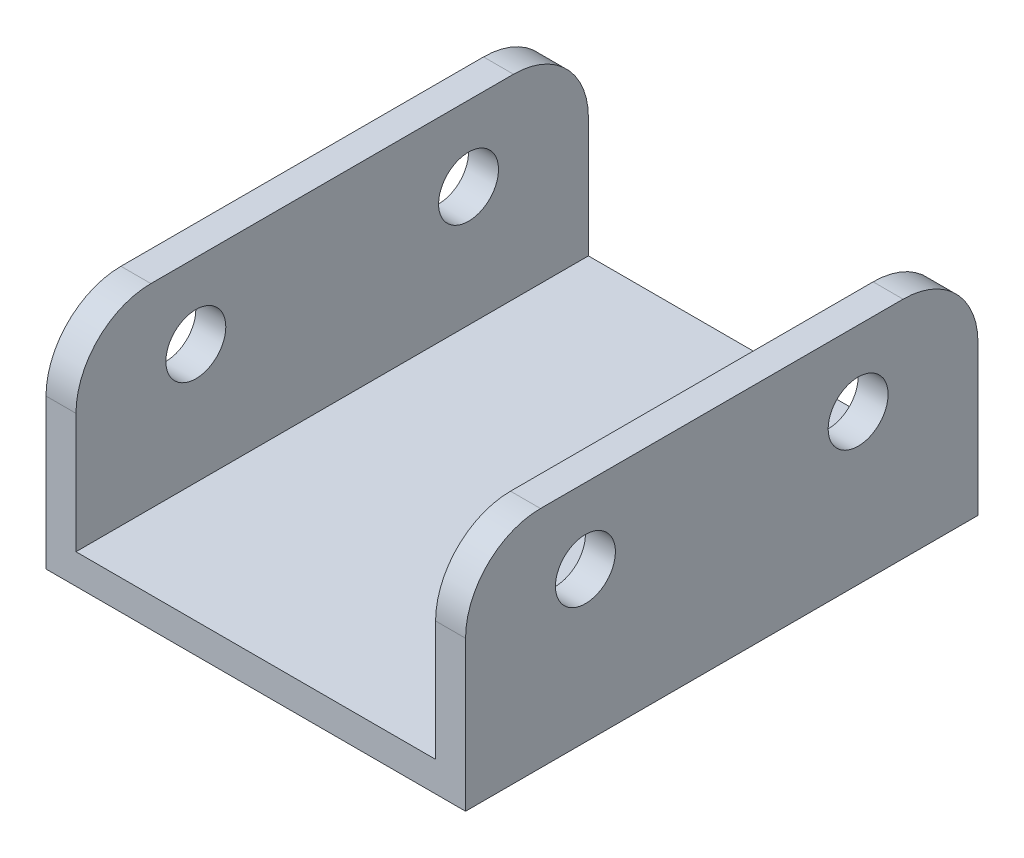
ISO-10303-21;
HEADER;
FILE_DESCRIPTION(('STEP AP214'),'2;1');
FILE_NAME('part.step','',(''),(''),'','','');
FILE_SCHEMA(('AUTOMOTIVE_DESIGN { 1 0 10303 214 1 1 1 1 }'));
ENDSEC;
DATA;
#1=APPLICATION_CONTEXT('core data for automotive mechanical design processes');
#2=APPLICATION_PROTOCOL_DEFINITION('international standard','automotive_design',2000,#1);
#3=PRODUCT_CONTEXT('',#1,'mechanical');
#4=PRODUCT('Part','Part','',(#3));
#5=PRODUCT_RELATED_PRODUCT_CATEGORY('part','',(#4));
#6=PRODUCT_DEFINITION_FORMATION('','',#4);
#7=PRODUCT_DEFINITION_CONTEXT('part definition',#1,'design');
#8=PRODUCT_DEFINITION('design','',#6,#7);
#9=PRODUCT_DEFINITION_SHAPE('','',#8);
#10=(LENGTH_UNIT() NAMED_UNIT(*) SI_UNIT(.MILLI.,.METRE.));
#11=(NAMED_UNIT(*) PLANE_ANGLE_UNIT() SI_UNIT($,.RADIAN.));
#12=(NAMED_UNIT(*) SI_UNIT($,.STERADIAN.) SOLID_ANGLE_UNIT());
#13=UNCERTAINTY_MEASURE_WITH_UNIT(LENGTH_MEASURE(1.E-05),#10,'distance_accuracy_value','');
#14=(GEOMETRIC_REPRESENTATION_CONTEXT(3) GLOBAL_UNCERTAINTY_ASSIGNED_CONTEXT((#13)) GLOBAL_UNIT_ASSIGNED_CONTEXT((#10,
#11,#12)) REPRESENTATION_CONTEXT('',''));
#15=CARTESIAN_POINT('',(0.,0.,0.));
#16=DIRECTION('',(0.,0.,1.));
#17=DIRECTION('',(1.,0.,0.));
#18=AXIS2_PLACEMENT_3D('',#15,#16,#17);
#19=CARTESIAN_POINT('',(-14.,-1.00000000000001,17.1));
#20=DIRECTION('',(1.,0.,0.));
#21=DIRECTION('',(0.,1.,0.));
#22=AXIS2_PLACEMENT_3D('',#19,#20,#21);
#23=PLANE('',#22);
#24=CARTESIAN_POINT('',(-14.,8.99999999999999,9.1));
#25=DIRECTION('',(1.,0.,0.));
#26=DIRECTION('',(0.,0.,-1.));
#27=AXIS2_PLACEMENT_3D('',#24,#25,#26);
#28=CIRCLE('',#27,2.);
#29=CARTESIAN_POINT('',(-14.,8.99999999999999,7.1));
#30=VERTEX_POINT('',#29);
#31=EDGE_CURVE('E158',#30,#30,#28,.T.);
#32=ORIENTED_EDGE('',*,*,#31,.T.);
#33=EDGE_LOOP('',(#32));
#34=FACE_BOUND('',#33,.T.);
#35=CARTESIAN_POINT('',(-14.,8.99999999999999,-9.1));
#36=DIRECTION('',(1.,0.,0.));
#37=DIRECTION('',(0.,0.,1.));
#38=AXIS2_PLACEMENT_3D('',#35,#36,#37);
#39=CIRCLE('',#38,2.);
#40=CARTESIAN_POINT('',(-14.,8.99999999999999,-7.1));
#41=VERTEX_POINT('',#40);
#42=EDGE_CURVE('E434',#41,#41,#39,.T.);
#43=ORIENTED_EDGE('',*,*,#42,.T.);
#44=EDGE_LOOP('',(#43));
#45=FACE_BOUND('',#44,.T.);
#46=DIRECTION('',(0.,0.,-1.));
#47=VECTOR('',#46,1.);
#48=CARTESIAN_POINT('',(-14.,14.,17.1));
#49=LINE('',#48,#47);
#50=CARTESIAN_POINT('',(-14.,14.,12.1));
#51=VERTEX_POINT('',#50);
#52=CARTESIAN_POINT('',(-14.,14.,-12.1));
#53=VERTEX_POINT('',#52);
#54=EDGE_CURVE('E209',#51,#53,#49,.T.);
#55=ORIENTED_EDGE('',*,*,#54,.T.);
#56=CARTESIAN_POINT('',(-14.,8.99999999999999,-12.1));
#57=DIRECTION('',(1.,0.,0.));
#58=DIRECTION('',(0.,1.,0.));
#59=AXIS2_PLACEMENT_3D('',#56,#57,#58);
#60=CIRCLE('',#59,5.);
#61=CARTESIAN_POINT('',(-14.,8.99999999999999,-17.1));
#62=VERTEX_POINT('',#61);
#63=EDGE_CURVE('E184',#53,#62,#60,.F.);
#64=ORIENTED_EDGE('',*,*,#63,.T.);
#65=DIRECTION('',(0.,-1.,0.));
#66=VECTOR('',#65,1.);
#67=CARTESIAN_POINT('',(-14.,-1.00000000000001,-17.1));
#68=LINE('',#67,#66);
#69=CARTESIAN_POINT('',(-14.,-1.00000000000001,-17.1));
#70=VERTEX_POINT('',#69);
#71=EDGE_CURVE('E144',#62,#70,#68,.T.);
#72=ORIENTED_EDGE('',*,*,#71,.T.);
#73=DIRECTION('',(0.,0.,-1.));
#74=VECTOR('',#73,1.);
#75=CARTESIAN_POINT('',(-14.,-1.00000000000001,17.1));
#76=LINE('',#75,#74);
#77=CARTESIAN_POINT('',(-14.,-1.00000000000001,17.1));
#78=VERTEX_POINT('',#77);
#79=EDGE_CURVE('E136',#78,#70,#76,.T.);
#80=ORIENTED_EDGE('',*,*,#79,.F.);
#81=DIRECTION('',(0.,-1.,0.));
#82=VECTOR('',#81,1.);
#83=CARTESIAN_POINT('',(-14.,-1.00000000000001,17.1));
#84=LINE('',#83,#82);
#85=CARTESIAN_POINT('',(-14.,8.99999999999999,17.1));
#86=VERTEX_POINT('',#85);
#87=EDGE_CURVE('E123',#86,#78,#84,.T.);
#88=ORIENTED_EDGE('',*,*,#87,.F.);
#89=CARTESIAN_POINT('',(-14.,8.99999999999999,12.1));
#90=DIRECTION('',(1.,0.,0.));
#91=DIRECTION('',(0.,1.,0.));
#92=AXIS2_PLACEMENT_3D('',#89,#90,#91);
#93=CIRCLE('',#92,5.);
#94=EDGE_CURVE('E56',#86,#51,#93,.F.);
#95=ORIENTED_EDGE('',*,*,#94,.T.);
#96=EDGE_LOOP('',(#55,#64,#72,#80,#88,#95));
#97=FACE_BOUND('',#96,.T.);
#98=ADVANCED_FACE('F33',(#34,#45,#97),#23,.F.);
#99=CARTESIAN_POINT('',(14.,-1.,17.1));
#100=DIRECTION('',(0.,1.,0.));
#101=DIRECTION('',(-1.,0.,0.));
#102=AXIS2_PLACEMENT_3D('',#99,#100,#101);
#103=PLANE('',#102);
#104=DIRECTION('',(1.,0.,0.));
#105=VECTOR('',#104,1.);
#106=CARTESIAN_POINT('',(14.,-1.,-17.1));
#107=LINE('',#106,#105);
#108=CARTESIAN_POINT('',(14.,-1.,-17.1));
#109=VERTEX_POINT('',#108);
#110=EDGE_CURVE('E211',#70,#109,#107,.T.);
#111=ORIENTED_EDGE('',*,*,#110,.T.);
#112=DIRECTION('',(0.,0.,-1.));
#113=VECTOR('',#112,1.);
#114=CARTESIAN_POINT('',(14.,-1.,17.1));
#115=LINE('',#114,#113);
#116=CARTESIAN_POINT('',(14.,-1.,17.1));
#117=VERTEX_POINT('',#116);
#118=EDGE_CURVE('E138',#117,#109,#115,.T.);
#119=ORIENTED_EDGE('',*,*,#118,.F.);
#120=DIRECTION('',(1.,0.,0.));
#121=VECTOR('',#120,1.);
#122=CARTESIAN_POINT('',(14.,-1.,17.1));
#123=LINE('',#122,#121);
#124=EDGE_CURVE('E127',#78,#117,#123,.T.);
#125=ORIENTED_EDGE('',*,*,#124,.F.);
#126=ORIENTED_EDGE('',*,*,#79,.T.);
#127=EDGE_LOOP('',(#111,#119,#125,#126));
#128=FACE_BOUND('',#127,.T.);
#129=ADVANCED_FACE('F135',(#128),#103,.F.);
#130=CARTESIAN_POINT('',(14.,-1.,17.1));
#131=DIRECTION('',(-1.,0.,0.));
#132=DIRECTION('',(0.,0.,1.));
#133=AXIS2_PLACEMENT_3D('',#130,#131,#132);
#134=PLANE('',#133);
#135=CARTESIAN_POINT('',(14.,8.99999999999999,9.1));
#136=DIRECTION('',(-1.,0.,0.));
#137=DIRECTION('',(0.,0.,1.));
#138=AXIS2_PLACEMENT_3D('',#135,#136,#137);
#139=CIRCLE('',#138,2.);
#140=CARTESIAN_POINT('',(14.,8.99999999999999,11.1));
#141=VERTEX_POINT('',#140);
#142=EDGE_CURVE('E212',#141,#141,#139,.T.);
#143=ORIENTED_EDGE('',*,*,#142,.T.);
#144=EDGE_LOOP('',(#143));
#145=FACE_BOUND('',#144,.T.);
#146=CARTESIAN_POINT('',(14.,8.99999999999999,-9.1));
#147=DIRECTION('',(-1.,0.,0.));
#148=DIRECTION('',(0.,0.,1.));
#149=AXIS2_PLACEMENT_3D('',#146,#147,#148);
#150=CIRCLE('',#149,2.);
#151=CARTESIAN_POINT('',(14.,8.99999999999999,-7.1));
#152=VERTEX_POINT('',#151);
#153=EDGE_CURVE('E162',#152,#152,#150,.T.);
#154=ORIENTED_EDGE('',*,*,#153,.T.);
#155=EDGE_LOOP('',(#154));
#156=FACE_BOUND('',#155,.T.);
#157=DIRECTION('',(0.,1.,0.));
#158=VECTOR('',#157,1.);
#159=CARTESIAN_POINT('',(14.,-1.,-17.1));
#160=LINE('',#159,#158);
#161=CARTESIAN_POINT('',(14.,8.99999999999999,-17.1));
#162=VERTEX_POINT('',#161);
#163=EDGE_CURVE('E214',#109,#162,#160,.T.);
#164=ORIENTED_EDGE('',*,*,#163,.T.);
#165=CARTESIAN_POINT('',(14.,8.99999999999999,-12.1));
#166=DIRECTION('',(-1.,0.,0.));
#167=DIRECTION('',(0.,0.,1.));
#168=AXIS2_PLACEMENT_3D('',#165,#166,#167);
#169=CIRCLE('',#168,5.);
#170=CARTESIAN_POINT('',(14.,14.,-12.1));
#171=VERTEX_POINT('',#170);
#172=EDGE_CURVE('E176',#162,#171,#169,.F.);
#173=ORIENTED_EDGE('',*,*,#172,.T.);
#174=DIRECTION('',(0.,0.,-1.));
#175=VECTOR('',#174,1.);
#176=CARTESIAN_POINT('',(14.,14.,17.1));
#177=LINE('',#176,#175);
#178=CARTESIAN_POINT('',(14.,14.,12.1));
#179=VERTEX_POINT('',#178);
#180=EDGE_CURVE('E150',#179,#171,#177,.T.);
#181=ORIENTED_EDGE('',*,*,#180,.F.);
#182=CARTESIAN_POINT('',(14.,8.99999999999999,12.1));
#183=DIRECTION('',(-1.,0.,0.));
#184=DIRECTION('',(0.,0.,1.));
#185=AXIS2_PLACEMENT_3D('',#182,#183,#184);
#186=CIRCLE('',#185,5.);
#187=CARTESIAN_POINT('',(14.,8.99999999999999,17.1));
#188=VERTEX_POINT('',#187);
#189=EDGE_CURVE('E174',#179,#188,#186,.F.);
#190=ORIENTED_EDGE('',*,*,#189,.T.);
#191=DIRECTION('',(0.,1.,0.));
#192=VECTOR('',#191,1.);
#193=CARTESIAN_POINT('',(14.,-1.,17.1));
#194=LINE('',#193,#192);
#195=EDGE_CURVE('E140',#117,#188,#194,.T.);
#196=ORIENTED_EDGE('',*,*,#195,.F.);
#197=ORIENTED_EDGE('',*,*,#118,.T.);
#198=EDGE_LOOP('',(#164,#173,#181,#190,#196,#197));
#199=FACE_BOUND('',#198,.T.);
#200=ADVANCED_FACE('F262',(#145,#156,#199),#134,.F.);
#201=CARTESIAN_POINT('',(14.,14.,17.1));
#202=DIRECTION('',(0.,-1.,0.));
#203=DIRECTION('',(0.,0.,-1.));
#204=AXIS2_PLACEMENT_3D('',#201,#202,#203);
#205=PLANE('',#204);
#206=ORIENTED_EDGE('',*,*,#180,.T.);
#207=DIRECTION('',(-1.,0.,0.));
#208=VECTOR('',#207,1.);
#209=CARTESIAN_POINT('',(12.,14.,-12.1));
#210=LINE('',#209,#208);
#211=CARTESIAN_POINT('',(12.,14.,-12.1));
#212=VERTEX_POINT('',#211);
#213=EDGE_CURVE('E148',#171,#212,#210,.T.);
#214=ORIENTED_EDGE('',*,*,#213,.T.);
#215=DIRECTION('',(0.,0.,-1.));
#216=VECTOR('',#215,1.);
#217=CARTESIAN_POINT('',(12.,14.,17.1));
#218=LINE('',#217,#216);
#219=CARTESIAN_POINT('',(12.,14.,12.1));
#220=VERTEX_POINT('',#219);
#221=EDGE_CURVE('E231',#220,#212,#218,.T.);
#222=ORIENTED_EDGE('',*,*,#221,.F.);
#223=DIRECTION('',(-1.,0.,0.));
#224=VECTOR('',#223,1.);
#225=CARTESIAN_POINT('',(14.,14.,12.1));
#226=LINE('',#225,#224);
#227=EDGE_CURVE('E146',#220,#179,#226,.F.);
#228=ORIENTED_EDGE('',*,*,#227,.T.);
#229=EDGE_LOOP('',(#206,#214,#222,#228));
#230=FACE_BOUND('',#229,.T.);
#231=ADVANCED_FACE('F236',(#230),#205,.F.);
#232=CARTESIAN_POINT('',(12.,14.,17.1));
#233=DIRECTION('',(1.,0.,0.));
#234=DIRECTION('',(0.,1.,0.));
#235=AXIS2_PLACEMENT_3D('',#232,#233,#234);
#236=PLANE('',#235);
#237=CARTESIAN_POINT('',(12.,8.99999999999999,9.1));
#238=DIRECTION('',(1.,0.,0.));
#239=DIRECTION('',(0.,1.,0.));
#240=AXIS2_PLACEMENT_3D('',#237,#238,#239);
#241=CIRCLE('',#240,2.);
#242=CARTESIAN_POINT('',(12.,11.,9.1));
#243=VERTEX_POINT('',#242);
#244=EDGE_CURVE('E161',#243,#243,#241,.T.);
#245=ORIENTED_EDGE('',*,*,#244,.T.);
#246=EDGE_LOOP('',(#245));
#247=FACE_BOUND('',#246,.T.);
#248=CARTESIAN_POINT('',(12.,8.99999999999999,-9.1));
#249=DIRECTION('',(1.,0.,0.));
#250=DIRECTION('',(0.,1.,0.));
#251=AXIS2_PLACEMENT_3D('',#248,#249,#250);
#252=CIRCLE('',#251,2.);
#253=CARTESIAN_POINT('',(12.,11.,-9.1));
#254=VERTEX_POINT('',#253);
#255=EDGE_CURVE('E157',#254,#254,#252,.T.);
#256=ORIENTED_EDGE('',*,*,#255,.T.);
#257=EDGE_LOOP('',(#256));
#258=FACE_BOUND('',#257,.T.);
#259=ORIENTED_EDGE('',*,*,#221,.T.);
#260=CARTESIAN_POINT('',(12.,8.99999999999999,-12.1));
#261=DIRECTION('',(1.,0.,0.));
#262=DIRECTION('',(0.,1.,0.));
#263=AXIS2_PLACEMENT_3D('',#260,#261,#262);
#264=CIRCLE('',#263,5.);
#265=CARTESIAN_POINT('',(12.,8.99999999999999,-17.1));
#266=VERTEX_POINT('',#265);
#267=EDGE_CURVE('E168',#212,#266,#264,.F.);
#268=ORIENTED_EDGE('',*,*,#267,.T.);
#269=DIRECTION('',(0.,-1.,0.));
#270=VECTOR('',#269,1.);
#271=CARTESIAN_POINT('',(12.,14.,-17.1));
#272=LINE('',#271,#270);
#273=CARTESIAN_POINT('',(12.,1.,-17.1));
#274=VERTEX_POINT('',#273);
#275=EDGE_CURVE('E217',#266,#274,#272,.T.);
#276=ORIENTED_EDGE('',*,*,#275,.T.);
#277=DIRECTION('',(0.,0.,-1.));
#278=VECTOR('',#277,1.);
#279=CARTESIAN_POINT('',(12.,1.,17.1));
#280=LINE('',#279,#278);
#281=CARTESIAN_POINT('',(12.,1.,17.1));
#282=VERTEX_POINT('',#281);
#283=EDGE_CURVE('E200',#282,#274,#280,.T.);
#284=ORIENTED_EDGE('',*,*,#283,.F.);
#285=DIRECTION('',(0.,-1.,0.));
#286=VECTOR('',#285,1.);
#287=CARTESIAN_POINT('',(12.,14.,17.1));
#288=LINE('',#287,#286);
#289=CARTESIAN_POINT('',(12.,8.99999999999999,17.1));
#290=VERTEX_POINT('',#289);
#291=EDGE_CURVE('E191',#290,#282,#288,.T.);
#292=ORIENTED_EDGE('',*,*,#291,.F.);
#293=CARTESIAN_POINT('',(12.,8.99999999999999,12.1));
#294=DIRECTION('',(1.,0.,0.));
#295=DIRECTION('',(0.,1.,0.));
#296=AXIS2_PLACEMENT_3D('',#293,#294,#295);
#297=CIRCLE('',#296,5.);
#298=EDGE_CURVE('E166',#290,#220,#297,.F.);
#299=ORIENTED_EDGE('',*,*,#298,.T.);
#300=EDGE_LOOP('',(#259,#268,#276,#284,#292,#299));
#301=FACE_BOUND('',#300,.T.);
#302=ADVANCED_FACE('F197',(#247,#258,#301),#236,.F.);
#303=CARTESIAN_POINT('',(-12.,1.,17.1));
#304=DIRECTION('',(0.,-1.,0.));
#305=DIRECTION('',(1.,0.,0.));
#306=AXIS2_PLACEMENT_3D('',#303,#304,#305);
#307=PLANE('',#306);
#308=DIRECTION('',(-1.,0.,0.));
#309=VECTOR('',#308,1.);
#310=CARTESIAN_POINT('',(-12.,1.,-17.1));
#311=LINE('',#310,#309);
#312=CARTESIAN_POINT('',(-12.,1.,-17.1));
#313=VERTEX_POINT('',#312);
#314=EDGE_CURVE('E219',#274,#313,#311,.T.);
#315=ORIENTED_EDGE('',*,*,#314,.T.);
#316=DIRECTION('',(0.,0.,-1.));
#317=VECTOR('',#316,1.);
#318=CARTESIAN_POINT('',(-12.,1.,17.1));
#319=LINE('',#318,#317);
#320=CARTESIAN_POINT('',(-12.,1.,17.1));
#321=VERTEX_POINT('',#320);
#322=EDGE_CURVE('E227',#321,#313,#319,.T.);
#323=ORIENTED_EDGE('',*,*,#322,.F.);
#324=DIRECTION('',(-1.,0.,0.));
#325=VECTOR('',#324,1.);
#326=CARTESIAN_POINT('',(-12.,1.,17.1));
#327=LINE('',#326,#325);
#328=EDGE_CURVE('E202',#282,#321,#327,.T.);
#329=ORIENTED_EDGE('',*,*,#328,.F.);
#330=ORIENTED_EDGE('',*,*,#283,.T.);
#331=EDGE_LOOP('',(#315,#323,#329,#330));
#332=FACE_BOUND('',#331,.T.);
#333=ADVANCED_FACE('F251',(#332),#307,.F.);
#334=CARTESIAN_POINT('',(-12.,14.,17.1));
#335=DIRECTION('',(-1.,0.,0.));
#336=DIRECTION('',(0.,-1.,0.));
#337=AXIS2_PLACEMENT_3D('',#334,#335,#336);
#338=PLANE('',#337);
#339=CARTESIAN_POINT('',(-12.,8.99999999999999,9.1));
#340=DIRECTION('',(-1.,0.,0.));
#341=DIRECTION('',(0.,-1.,0.));
#342=AXIS2_PLACEMENT_3D('',#339,#340,#341);
#343=CIRCLE('',#342,2.);
#344=CARTESIAN_POINT('',(-12.,6.99999999999999,9.1));
#345=VERTEX_POINT('',#344);
#346=EDGE_CURVE('E159',#345,#345,#343,.T.);
#347=ORIENTED_EDGE('',*,*,#346,.T.);
#348=EDGE_LOOP('',(#347));
#349=FACE_BOUND('',#348,.T.);
#350=CARTESIAN_POINT('',(-12.,8.99999999999999,-9.1));
#351=DIRECTION('',(-1.,0.,0.));
#352=DIRECTION('',(0.,-1.,0.));
#353=AXIS2_PLACEMENT_3D('',#350,#351,#352);
#354=CIRCLE('',#353,2.);
#355=CARTESIAN_POINT('',(-12.,6.99999999999999,-9.1));
#356=VERTEX_POINT('',#355);
#357=EDGE_CURVE('E154',#356,#356,#354,.T.);
#358=ORIENTED_EDGE('',*,*,#357,.T.);
#359=EDGE_LOOP('',(#358));
#360=FACE_BOUND('',#359,.T.);
#361=DIRECTION('',(0.,1.,0.));
#362=VECTOR('',#361,1.);
#363=CARTESIAN_POINT('',(-12.,14.,-17.1));
#364=LINE('',#363,#362);
#365=CARTESIAN_POINT('',(-12.,8.99999999999999,-17.1));
#366=VERTEX_POINT('',#365);
#367=EDGE_CURVE('E131',#313,#366,#364,.T.);
#368=ORIENTED_EDGE('',*,*,#367,.T.);
#369=CARTESIAN_POINT('',(-12.,8.99999999999999,-12.1));
#370=DIRECTION('',(-1.,0.,0.));
#371=DIRECTION('',(0.,-1.,0.));
#372=AXIS2_PLACEMENT_3D('',#369,#370,#371);
#373=CIRCLE('',#372,5.);
#374=CARTESIAN_POINT('',(-12.,14.,-12.1));
#375=VERTEX_POINT('',#374);
#376=EDGE_CURVE('E187',#366,#375,#373,.F.);
#377=ORIENTED_EDGE('',*,*,#376,.T.);
#378=DIRECTION('',(0.,0.,-1.));
#379=VECTOR('',#378,1.);
#380=CARTESIAN_POINT('',(-12.,14.,17.1));
#381=LINE('',#380,#379);
#382=CARTESIAN_POINT('',(-12.,14.,12.1));
#383=VERTEX_POINT('',#382);
#384=EDGE_CURVE('E224',#383,#375,#381,.T.);
#385=ORIENTED_EDGE('',*,*,#384,.F.);
#386=CARTESIAN_POINT('',(-12.,8.99999999999999,12.1));
#387=DIRECTION('',(-1.,0.,0.));
#388=DIRECTION('',(0.,-1.,0.));
#389=AXIS2_PLACEMENT_3D('',#386,#387,#388);
#390=CIRCLE('',#389,5.);
#391=CARTESIAN_POINT('',(-12.,8.99999999999999,17.1));
#392=VERTEX_POINT('',#391);
#393=EDGE_CURVE('E48',#383,#392,#390,.F.);
#394=ORIENTED_EDGE('',*,*,#393,.T.);
#395=DIRECTION('',(0.,1.,0.));
#396=VECTOR('',#395,1.);
#397=CARTESIAN_POINT('',(-12.,14.,17.1));
#398=LINE('',#397,#396);
#399=EDGE_CURVE('E204',#321,#392,#398,.T.);
#400=ORIENTED_EDGE('',*,*,#399,.F.);
#401=ORIENTED_EDGE('',*,*,#322,.T.);
#402=EDGE_LOOP('',(#368,#377,#385,#394,#400,#401));
#403=FACE_BOUND('',#402,.T.);
#404=ADVANCED_FACE('F252',(#349,#360,#403),#338,.F.);
#405=CARTESIAN_POINT('',(-14.,14.,17.1));
#406=DIRECTION('',(0.,-1.,0.));
#407=DIRECTION('',(0.,0.,-1.));
#408=AXIS2_PLACEMENT_3D('',#405,#406,#407);
#409=PLANE('',#408);
#410=ORIENTED_EDGE('',*,*,#384,.T.);
#411=DIRECTION('',(-1.,0.,0.));
#412=VECTOR('',#411,1.);
#413=CARTESIAN_POINT('',(-14.,14.,-12.1));
#414=LINE('',#413,#412);
#415=EDGE_CURVE('E180',#375,#53,#414,.T.);
#416=ORIENTED_EDGE('',*,*,#415,.T.);
#417=ORIENTED_EDGE('',*,*,#54,.F.);
#418=DIRECTION('',(-1.,0.,0.));
#419=VECTOR('',#418,1.);
#420=CARTESIAN_POINT('',(-14.,14.,12.1));
#421=LINE('',#420,#419);
#422=EDGE_CURVE('E178',#51,#383,#421,.F.);
#423=ORIENTED_EDGE('',*,*,#422,.T.);
#424=EDGE_LOOP('',(#410,#416,#417,#423));
#425=FACE_BOUND('',#424,.T.);
#426=ADVANCED_FACE('F257',(#425),#409,.F.);
#427=CARTESIAN_POINT('',(0.,0.,17.1));
#428=DIRECTION('',(0.,0.,-1.));
#429=DIRECTION('',(-1.,0.,0.));
#430=AXIS2_PLACEMENT_3D('',#427,#428,#429);
#431=PLANE('',#430);
#432=ORIENTED_EDGE('',*,*,#399,.T.);
#433=DIRECTION('',(-1.,0.,0.));
#434=VECTOR('',#433,1.);
#435=CARTESIAN_POINT('',(0.,8.99999999999999,17.1));
#436=LINE('',#435,#434);
#437=EDGE_CURVE('E11',#392,#86,#436,.T.);
#438=ORIENTED_EDGE('',*,*,#437,.T.);
#439=ORIENTED_EDGE('',*,*,#87,.T.);
#440=ORIENTED_EDGE('',*,*,#124,.T.);
#441=ORIENTED_EDGE('',*,*,#195,.T.);
#442=DIRECTION('',(-1.,0.,0.));
#443=VECTOR('',#442,1.);
#444=CARTESIAN_POINT('',(0.,8.99999999999999,17.1));
#445=LINE('',#444,#443);
#446=EDGE_CURVE('E41',#188,#290,#445,.T.);
#447=ORIENTED_EDGE('',*,*,#446,.T.);
#448=ORIENTED_EDGE('',*,*,#291,.T.);
#449=ORIENTED_EDGE('',*,*,#328,.T.);
#450=EDGE_LOOP('',(#432,#438,#439,#440,#441,#447,#448,#449));
#451=FACE_BOUND('',#450,.T.);
#452=ADVANCED_FACE('F125',(#451),#431,.F.);
#453=CARTESIAN_POINT('',(0.,0.,-17.1));
#454=DIRECTION('',(0.,0.,-1.));
#455=DIRECTION('',(-1.,0.,0.));
#456=AXIS2_PLACEMENT_3D('',#453,#454,#455);
#457=PLANE('',#456);
#458=ORIENTED_EDGE('',*,*,#275,.F.);
#459=DIRECTION('',(-1.,0.,0.));
#460=VECTOR('',#459,1.);
#461=CARTESIAN_POINT('',(14.,8.99999999999999,-17.1));
#462=LINE('',#461,#460);
#463=EDGE_CURVE('E172',#266,#162,#462,.F.);
#464=ORIENTED_EDGE('',*,*,#463,.T.);
#465=ORIENTED_EDGE('',*,*,#163,.F.);
#466=ORIENTED_EDGE('',*,*,#110,.F.);
#467=ORIENTED_EDGE('',*,*,#71,.F.);
#468=DIRECTION('',(-1.,0.,0.));
#469=VECTOR('',#468,1.);
#470=CARTESIAN_POINT('',(-12.,8.99999999999999,-17.1));
#471=LINE('',#470,#469);
#472=EDGE_CURVE('E170',#62,#366,#471,.F.);
#473=ORIENTED_EDGE('',*,*,#472,.T.);
#474=ORIENTED_EDGE('',*,*,#367,.F.);
#475=ORIENTED_EDGE('',*,*,#314,.F.);
#476=EDGE_LOOP('',(#458,#464,#465,#466,#467,#473,#474,#475));
#477=FACE_BOUND('',#476,.T.);
#478=ADVANCED_FACE('F246',(#477),#457,.T.);
#479=CARTESIAN_POINT('',(-14.,8.99999999999999,-9.1));
#480=DIRECTION('',(1.,0.,0.));
#481=DIRECTION('',(0.,0.,-1.));
#482=AXIS2_PLACEMENT_3D('',#479,#480,#481);
#483=CYLINDRICAL_SURFACE('',#482,2.);
#484=ORIENTED_EDGE('',*,*,#42,.F.);
#485=EDGE_LOOP('',(#484));
#486=FACE_BOUND('',#485,.T.);
#487=ORIENTED_EDGE('',*,*,#357,.F.);
#488=EDGE_LOOP('',(#487));
#489=FACE_BOUND('',#488,.T.);
#490=ADVANCED_FACE('F323',(#486,#489),#483,.F.);
#491=CARTESIAN_POINT('',(-14.,8.99999999999999,9.1));
#492=DIRECTION('',(1.,0.,0.));
#493=DIRECTION('',(0.,0.,-1.));
#494=AXIS2_PLACEMENT_3D('',#491,#492,#493);
#495=CYLINDRICAL_SURFACE('',#494,2.);
#496=ORIENTED_EDGE('',*,*,#31,.F.);
#497=EDGE_LOOP('',(#496));
#498=FACE_BOUND('',#497,.T.);
#499=ORIENTED_EDGE('',*,*,#346,.F.);
#500=EDGE_LOOP('',(#499));
#501=FACE_BOUND('',#500,.T.);
#502=ADVANCED_FACE('F314',(#498,#501),#495,.F.);
#503=ORIENTED_EDGE('',*,*,#255,.F.);
#504=EDGE_LOOP('',(#503));
#505=FACE_BOUND('',#504,.T.);
#506=ORIENTED_EDGE('',*,*,#153,.F.);
#507=EDGE_LOOP('',(#506));
#508=FACE_BOUND('',#507,.T.);
#509=ADVANCED_FACE('F311',(#505,#508),#483,.F.);
#510=ORIENTED_EDGE('',*,*,#244,.F.);
#511=EDGE_LOOP('',(#510));
#512=FACE_BOUND('',#511,.T.);
#513=ORIENTED_EDGE('',*,*,#142,.F.);
#514=EDGE_LOOP('',(#513));
#515=FACE_BOUND('',#514,.T.);
#516=ADVANCED_FACE('F280',(#512,#515),#495,.F.);
#517=CARTESIAN_POINT('',(14.,8.99999999999999,-12.1));
#518=DIRECTION('',(1.,0.,0.));
#519=DIRECTION('',(0.,0.,-1.));
#520=AXIS2_PLACEMENT_3D('',#517,#518,#519);
#521=CYLINDRICAL_SURFACE('',#520,5.);
#522=ORIENTED_EDGE('',*,*,#172,.F.);
#523=ORIENTED_EDGE('',*,*,#463,.F.);
#524=ORIENTED_EDGE('',*,*,#267,.F.);
#525=ORIENTED_EDGE('',*,*,#213,.F.);
#526=EDGE_LOOP('',(#522,#523,#524,#525));
#527=FACE_BOUND('',#526,.T.);
#528=ADVANCED_FACE('F241',(#527),#521,.T.);
#529=CARTESIAN_POINT('',(-14.,8.99999999999999,-12.1));
#530=DIRECTION('',(1.,0.,0.));
#531=DIRECTION('',(0.,0.,-1.));
#532=AXIS2_PLACEMENT_3D('',#529,#530,#531);
#533=CYLINDRICAL_SURFACE('',#532,5.);
#534=ORIENTED_EDGE('',*,*,#376,.F.);
#535=ORIENTED_EDGE('',*,*,#472,.F.);
#536=ORIENTED_EDGE('',*,*,#63,.F.);
#537=ORIENTED_EDGE('',*,*,#415,.F.);
#538=EDGE_LOOP('',(#534,#535,#536,#537));
#539=FACE_BOUND('',#538,.T.);
#540=ADVANCED_FACE('F261',(#539),#533,.T.);
#541=CARTESIAN_POINT('',(0.,8.99999999999999,12.1));
#542=DIRECTION('',(-1.,0.,0.));
#543=DIRECTION('',(0.,0.,1.));
#544=AXIS2_PLACEMENT_3D('',#541,#542,#543);
#545=CYLINDRICAL_SURFACE('',#544,5.);
#546=ORIENTED_EDGE('',*,*,#393,.F.);
#547=ORIENTED_EDGE('',*,*,#422,.F.);
#548=ORIENTED_EDGE('',*,*,#94,.F.);
#549=ORIENTED_EDGE('',*,*,#437,.F.);
#550=EDGE_LOOP('',(#546,#547,#548,#549));
#551=FACE_BOUND('',#550,.T.);
#552=ADVANCED_FACE('F254',(#551),#545,.T.);
#553=CARTESIAN_POINT('',(0.,8.99999999999999,12.1));
#554=DIRECTION('',(-1.,0.,0.));
#555=DIRECTION('',(0.,0.,1.));
#556=AXIS2_PLACEMENT_3D('',#553,#554,#555);
#557=CYLINDRICAL_SURFACE('',#556,5.);
#558=ORIENTED_EDGE('',*,*,#189,.F.);
#559=ORIENTED_EDGE('',*,*,#227,.F.);
#560=ORIENTED_EDGE('',*,*,#298,.F.);
#561=ORIENTED_EDGE('',*,*,#446,.F.);
#562=EDGE_LOOP('',(#558,#559,#560,#561));
#563=FACE_BOUND('',#562,.T.);
#564=ADVANCED_FACE('F35',(#563),#557,.T.);
#565=CLOSED_SHELL('',(#98,#129,#200,#231,#302,#333,#404,#426,#452,#478,#490,#502,#509,#516,#528,
#540,#552,#564));
#566=MANIFOLD_SOLID_BREP('B2',#565);
#567=ADVANCED_BREP_SHAPE_REPRESENTATION('',(#18,#566),#14);
#568=SHAPE_DEFINITION_REPRESENTATION(#9,#567);
ENDSEC;
END-ISO-10303-21;
